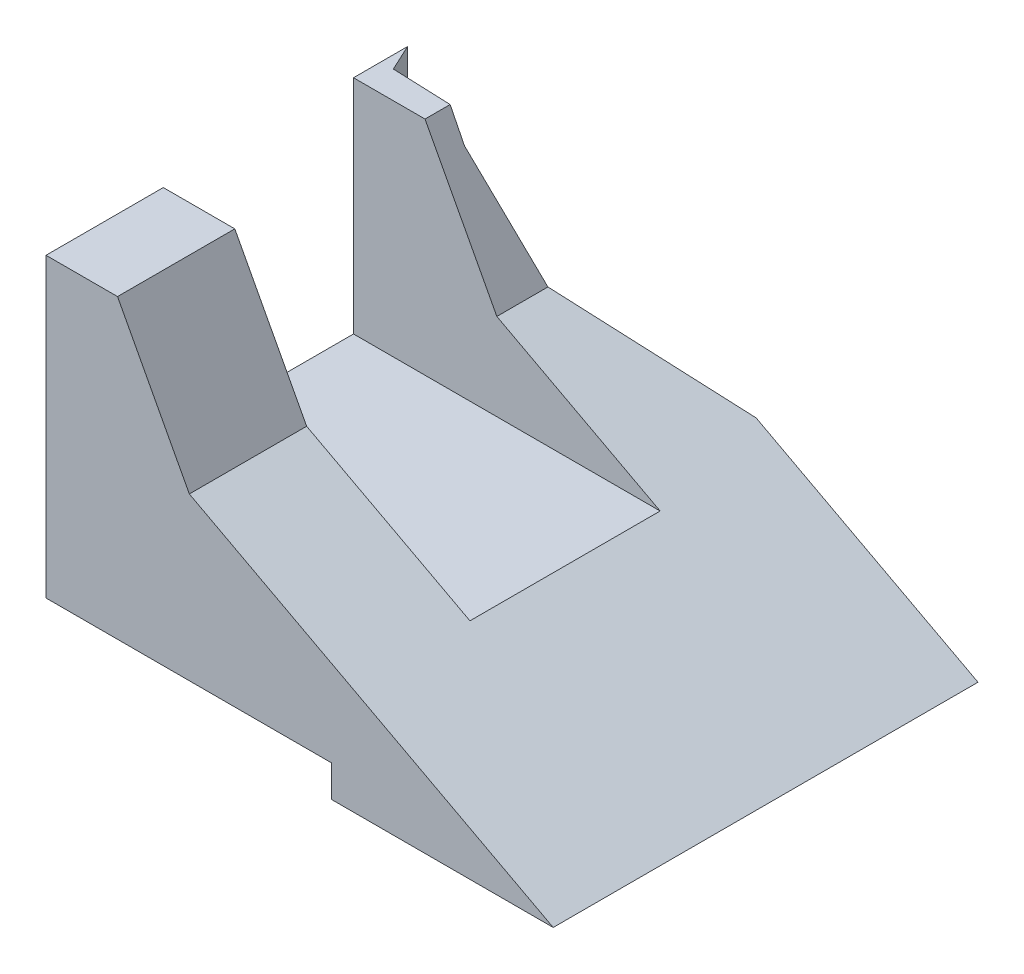
ISO-10303-21;
HEADER;
FILE_DESCRIPTION(('STEP AP214'),'2;1');
FILE_NAME('part.step','',(''),(''),'','','');
FILE_SCHEMA(('AUTOMOTIVE_DESIGN { 1 0 10303 214 1 1 1 1 }'));
ENDSEC;
DATA;
#1=APPLICATION_CONTEXT('core data for automotive mechanical design processes');
#2=APPLICATION_PROTOCOL_DEFINITION('international standard','automotive_design',2000,#1);
#3=PRODUCT_CONTEXT('',#1,'mechanical');
#4=PRODUCT('Part','Part','',(#3));
#5=PRODUCT_RELATED_PRODUCT_CATEGORY('part','',(#4));
#6=PRODUCT_DEFINITION_FORMATION('','',#4);
#7=PRODUCT_DEFINITION_CONTEXT('part definition',#1,'design');
#8=PRODUCT_DEFINITION('design','',#6,#7);
#9=PRODUCT_DEFINITION_SHAPE('','',#8);
#10=(LENGTH_UNIT() NAMED_UNIT(*) SI_UNIT(.MILLI.,.METRE.));
#11=(NAMED_UNIT(*) PLANE_ANGLE_UNIT() SI_UNIT($,.RADIAN.));
#12=(NAMED_UNIT(*) SI_UNIT($,.STERADIAN.) SOLID_ANGLE_UNIT());
#13=UNCERTAINTY_MEASURE_WITH_UNIT(LENGTH_MEASURE(1.E-05),#10,'distance_accuracy_value','');
#14=(GEOMETRIC_REPRESENTATION_CONTEXT(3) GLOBAL_UNCERTAINTY_ASSIGNED_CONTEXT((#13)) GLOBAL_UNIT_ASSIGNED_CONTEXT((#10,
#11,#12)) REPRESENTATION_CONTEXT('',''));
#15=CARTESIAN_POINT('',(0.,0.,0.));
#16=DIRECTION('',(0.,0.,1.));
#17=DIRECTION('',(1.,0.,0.));
#18=AXIS2_PLACEMENT_3D('',#15,#16,#17);
#19=CARTESIAN_POINT('',(80.,51.82,0.));
#20=DIRECTION('',(0.,-1.,0.));
#21=DIRECTION('',(0.,0.,-1.));
#22=AXIS2_PLACEMENT_3D('',#19,#20,#21);
#23=PLANE('',#22);
#24=DIRECTION('',(0.,0.,1.));
#25=VECTOR('',#24,1.);
#26=CARTESIAN_POINT('',(11.2806834744293,51.82,-67.001));
#27=LINE('',#26,#25);
#28=CARTESIAN_POINT('',(11.2806834744293,51.82,-52.4630565569461));
#29=VERTEX_POINT('',#28);
#30=CARTESIAN_POINT('',(11.2806834744293,51.82,-48.5));
#31=VERTEX_POINT('',#30);
#32=EDGE_CURVE('E222',#29,#31,#27,.T.);
#33=ORIENTED_EDGE('',*,*,#32,.F.);
#34=DIRECTION('',(0.99921657202049,0.,0.0395757779408101));
#35=VECTOR('',#34,1.);
#36=CARTESIAN_POINT('',(13.6262026525727,51.82,-52.3701580314919));
#37=LINE('',#36,#35);
#38=CARTESIAN_POINT('',(1.95443562586019,51.82,-52.8324394557201));
#39=VERTEX_POINT('',#38);
#40=EDGE_CURVE('E273',#39,#29,#37,.T.);
#41=ORIENTED_EDGE('',*,*,#40,.F.);
#42=DIRECTION('',(0.422618261740693,0.,0.906307787036653));
#43=VECTOR('',#42,1.);
#44=CARTESIAN_POINT('',(1.95443562586019,51.82,-52.8324394557201));
#45=LINE('',#44,#43);
#46=CARTESIAN_POINT('',(0.,51.82,-57.0237401810678));
#47=VERTEX_POINT('',#46);
#48=EDGE_CURVE('E161',#47,#39,#45,.T.);
#49=ORIENTED_EDGE('',*,*,#48,.F.);
#50=DIRECTION('',(0.,0.,1.));
#51=VECTOR('',#50,1.);
#52=CARTESIAN_POINT('',(0.,51.82,0.));
#53=LINE('',#52,#51);
#54=CARTESIAN_POINT('',(0.,51.82,-48.5));
#55=VERTEX_POINT('',#54);
#56=EDGE_CURVE('E227',#47,#55,#53,.T.);
#57=ORIENTED_EDGE('',*,*,#56,.T.);
#58=DIRECTION('',(-1.,0.,0.));
#59=VECTOR('',#58,1.);
#60=CARTESIAN_POINT('',(0.,51.82,-48.5));
#61=LINE('',#60,#59);
#62=EDGE_CURVE('E191',#31,#55,#61,.T.);
#63=ORIENTED_EDGE('',*,*,#62,.F.);
#64=EDGE_LOOP('',(#33,#41,#49,#57,#63));
#65=FACE_BOUND('',#64,.T.);
#66=ADVANCED_FACE('F33',(#65),#23,.F.);
#67=CARTESIAN_POINT('',(22.6084064641698,30.515651581083,-67.001));
#68=DIRECTION('',(-0.882947592858928,-0.469471562785888,0.));
#69=DIRECTION('',(0.469471562785889,-0.882947592858928,0.));
#70=AXIS2_PLACEMENT_3D('',#67,#68,#69);
#71=PLANE('',#70);
#72=DIRECTION('',(0.,0.,1.));
#73=VECTOR('',#72,1.);
#74=CARTESIAN_POINT('',(22.6084064641698,30.515651581083,-67.001));
#75=LINE('',#74,#73);
#76=CARTESIAN_POINT('',(22.6084064641698,30.515651581083,-56.5586284559486));
#77=VERTEX_POINT('',#76);
#78=CARTESIAN_POINT('',(22.6084064641698,30.515651581083,-48.5));
#79=VERTEX_POINT('',#78);
#80=EDGE_CURVE('E218',#77,#79,#75,.T.);
#81=ORIENTED_EDGE('',*,*,#80,.F.);
#82=DIRECTION('',(0.45861066994838,-0.862521224262136,-0.21385366750852));
#83=VECTOR('',#82,1.);
#84=CARTESIAN_POINT('',(40.4131443501285,-2.97019016959439,-64.8611140836134));
#85=LINE('',#84,#83);
#86=CARTESIAN_POINT('',(13.6262026525727,47.4087200066885,-52.3701580314919));
#87=VERTEX_POINT('',#86);
#88=EDGE_CURVE('E278',#87,#77,#85,.T.);
#89=ORIENTED_EDGE('',*,*,#88,.F.);
#90=DIRECTION('',(0.469390424665507,-0.882794994248578,0.0185910559675182));
#91=VECTOR('',#90,1.);
#92=CARTESIAN_POINT('',(33.2716299026864,10.4610450543633,-51.5920653855396));
#93=LINE('',#92,#91);
#94=EDGE_CURVE('E150',#29,#87,#93,.T.);
#95=ORIENTED_EDGE('',*,*,#94,.F.);
#96=ORIENTED_EDGE('',*,*,#32,.T.);
#97=DIRECTION('',(0.469471562785889,-0.882947592858928,0.));
#98=VECTOR('',#97,1.);
#99=CARTESIAN_POINT('',(22.6084064641698,30.515651581083,-48.5));
#100=LINE('',#99,#98);
#101=EDGE_CURVE('E41',#31,#79,#100,.T.);
#102=ORIENTED_EDGE('',*,*,#101,.T.);
#103=EDGE_LOOP('',(#81,#89,#95,#96,#102));
#104=FACE_BOUND('',#103,.T.);
#105=ADVANCED_FACE('F244',(#104),#71,.F.);
#106=CARTESIAN_POINT('',(80.,0.,0.));
#107=DIRECTION('',(0.,0.,-1.));
#108=DIRECTION('',(-1.,0.,0.));
#109=AXIS2_PLACEMENT_3D('',#106,#107,#108);
#110=PLANE('',#109);
#111=DIRECTION('',(0.,-1.,0.));
#112=VECTOR('',#111,1.);
#113=CARTESIAN_POINT('',(0.,0.,0.));
#114=LINE('',#113,#112);
#115=CARTESIAN_POINT('',(0.,51.82,0.));
#116=VERTEX_POINT('',#115);
#117=CARTESIAN_POINT('',(0.,5.,0.));
#118=VERTEX_POINT('',#117);
#119=EDGE_CURVE('E220',#116,#118,#114,.T.);
#120=ORIENTED_EDGE('',*,*,#119,.T.);
#121=DIRECTION('',(-1.,0.,0.));
#122=VECTOR('',#121,1.);
#123=CARTESIAN_POINT('',(0.,5.,0.));
#124=LINE('',#123,#122);
#125=CARTESIAN_POINT('',(45.,5.,0.));
#126=VERTEX_POINT('',#125);
#127=EDGE_CURVE('E177',#126,#118,#124,.T.);
#128=ORIENTED_EDGE('',*,*,#127,.F.);
#129=DIRECTION('',(0.,1.,0.));
#130=VECTOR('',#129,1.);
#131=CARTESIAN_POINT('',(45.,0.,0.));
#132=LINE('',#131,#130);
#133=CARTESIAN_POINT('',(45.,0.,0.));
#134=VERTEX_POINT('',#133);
#135=EDGE_CURVE('E168',#134,#126,#132,.T.);
#136=ORIENTED_EDGE('',*,*,#135,.F.);
#137=DIRECTION('',(-1.,0.,0.));
#138=VECTOR('',#137,1.);
#139=CARTESIAN_POINT('',(80.,0.,0.));
#140=LINE('',#139,#138);
#141=CARTESIAN_POINT('',(80.,0.,0.));
#142=VERTEX_POINT('',#141);
#143=EDGE_CURVE('E235',#142,#134,#140,.T.);
#144=ORIENTED_EDGE('',*,*,#143,.F.);
#145=DIRECTION('',(0.882947592858926,-0.469471562785892,0.));
#146=VECTOR('',#145,1.);
#147=CARTESIAN_POINT('',(80.,0.,0.));
#148=LINE('',#147,#146);
#149=CARTESIAN_POINT('',(22.6084064641698,30.515651581083,0.));
#150=VERTEX_POINT('',#149);
#151=EDGE_CURVE('E215',#150,#142,#148,.T.);
#152=ORIENTED_EDGE('',*,*,#151,.F.);
#153=DIRECTION('',(0.469471562785889,-0.882947592858928,0.));
#154=VECTOR('',#153,1.);
#155=CARTESIAN_POINT('',(22.6084064641698,30.515651581083,0.));
#156=LINE('',#155,#154);
#157=CARTESIAN_POINT('',(11.2806834744293,51.82,0.));
#158=VERTEX_POINT('',#157);
#159=EDGE_CURVE('E212',#158,#150,#156,.T.);
#160=ORIENTED_EDGE('',*,*,#159,.F.);
#161=DIRECTION('',(-1.,0.,0.));
#162=VECTOR('',#161,1.);
#163=CARTESIAN_POINT('',(80.,51.82,0.));
#164=LINE('',#163,#162);
#165=EDGE_CURVE('E226',#158,#116,#164,.T.);
#166=ORIENTED_EDGE('',*,*,#165,.T.);
#167=EDGE_LOOP('',(#120,#128,#136,#144,#152,#160,#166));
#168=FACE_BOUND('',#167,.T.);
#169=ADVANCED_FACE('F35',(#168),#110,.F.);
#170=CARTESIAN_POINT('',(80.,0.,0.));
#171=DIRECTION('',(0.,1.,0.));
#172=DIRECTION('',(0.,0.,1.));
#173=AXIS2_PLACEMENT_3D('',#170,#171,#172);
#174=PLANE('',#173);
#175=ORIENTED_EDGE('',*,*,#143,.T.);
#176=DIRECTION('',(0.,0.,1.));
#177=VECTOR('',#176,1.);
#178=CARTESIAN_POINT('',(45.,0.,-67.001));
#179=LINE('',#178,#177);
#180=CARTESIAN_POINT('',(45.,0.,-67.));
#181=VERTEX_POINT('',#180);
#182=EDGE_CURVE('E170',#181,#134,#179,.T.);
#183=ORIENTED_EDGE('',*,*,#182,.F.);
#184=DIRECTION('',(-1.,0.,0.));
#185=VECTOR('',#184,1.);
#186=CARTESIAN_POINT('',(80.,0.,-67.));
#187=LINE('',#186,#185);
#188=CARTESIAN_POINT('',(80.,0.,-67.));
#189=VERTEX_POINT('',#188);
#190=EDGE_CURVE('E175',#189,#181,#187,.T.);
#191=ORIENTED_EDGE('',*,*,#190,.F.);
#192=DIRECTION('',(0.,0.,-1.));
#193=VECTOR('',#192,1.);
#194=CARTESIAN_POINT('',(80.,0.,0.));
#195=LINE('',#194,#193);
#196=EDGE_CURVE('E224',#142,#189,#195,.T.);
#197=ORIENTED_EDGE('',*,*,#196,.F.);
#198=EDGE_LOOP('',(#175,#183,#191,#197));
#199=FACE_BOUND('',#198,.T.);
#200=ADVANCED_FACE('F266',(#199),#174,.F.);
#201=CARTESIAN_POINT('',(80.,0.,-67.));
#202=DIRECTION('',(0.,0.,1.));
#203=DIRECTION('',(1.,0.,0.));
#204=AXIS2_PLACEMENT_3D('',#201,#202,#203);
#205=PLANE('',#204);
#206=DIRECTION('',(0.,-1.,0.));
#207=VECTOR('',#206,1.);
#208=CARTESIAN_POINT('',(45.,0.,-67.));
#209=LINE('',#208,#207);
#210=CARTESIAN_POINT('',(45.,5.,-67.));
#211=VERTEX_POINT('',#210);
#212=EDGE_CURVE('E165',#211,#181,#209,.T.);
#213=ORIENTED_EDGE('',*,*,#212,.F.);
#214=DIRECTION('',(0.,-1.,0.));
#215=VECTOR('',#214,1.);
#216=CARTESIAN_POINT('',(45.,-0.001000000000001,-67.));
#217=LINE('',#216,#215);
#218=CARTESIAN_POINT('',(44.9999999999999,18.6098301081518,-67.));
#219=VERTEX_POINT('',#218);
#220=EDGE_CURVE('E138',#219,#211,#217,.T.);
#221=ORIENTED_EDGE('',*,*,#220,.F.);
#222=DIRECTION('',(-0.882947592858926,0.469471562785892,0.));
#223=VECTOR('',#222,1.);
#224=CARTESIAN_POINT('',(80.,0.,-67.));
#225=LINE('',#224,#223);
#226=EDGE_CURVE('E210',#189,#219,#225,.T.);
#227=ORIENTED_EDGE('',*,*,#226,.F.);
#228=ORIENTED_EDGE('',*,*,#190,.T.);
#229=EDGE_LOOP('',(#213,#221,#227,#228));
#230=FACE_BOUND('',#229,.T.);
#231=ADVANCED_FACE('F173',(#230),#205,.F.);
#232=CARTESIAN_POINT('',(11.2806834744293,51.82,-18.5));
#233=VERTEX_POINT('',#232);
#234=EDGE_CURVE('E217',#233,#158,#27,.T.);
#235=ORIENTED_EDGE('',*,*,#234,.F.);
#236=DIRECTION('',(1.,0.,0.));
#237=VECTOR('',#236,1.);
#238=CARTESIAN_POINT('',(0.,51.82,-18.5));
#239=LINE('',#238,#237);
#240=CARTESIAN_POINT('',(0.,51.82,-18.5));
#241=VERTEX_POINT('',#240);
#242=EDGE_CURVE('E184',#241,#233,#239,.T.);
#243=ORIENTED_EDGE('',*,*,#242,.F.);
#244=EDGE_CURVE('E230',#241,#116,#53,.T.);
#245=ORIENTED_EDGE('',*,*,#244,.T.);
#246=ORIENTED_EDGE('',*,*,#165,.F.);
#247=EDGE_LOOP('',(#235,#243,#245,#246));
#248=FACE_BOUND('',#247,.T.);
#249=ADVANCED_FACE('F293',(#248),#23,.F.);
#250=CARTESIAN_POINT('',(0.,0.,0.));
#251=DIRECTION('',(-1.,0.,0.));
#252=DIRECTION('',(0.,0.,1.));
#253=AXIS2_PLACEMENT_3D('',#250,#251,#252);
#254=PLANE('',#253);
#255=DIRECTION('',(0.,-1.,0.));
#256=VECTOR('',#255,1.);
#257=CARTESIAN_POINT('',(0.,-0.001000000000001,-57.0237401810678));
#258=LINE('',#257,#256);
#259=CARTESIAN_POINT('',(0.,5.,-57.0237401810678));
#260=VERTEX_POINT('',#259);
#261=EDGE_CURVE('E151',#47,#260,#258,.T.);
#262=ORIENTED_EDGE('',*,*,#261,.T.);
#263=DIRECTION('',(0.,0.,1.));
#264=VECTOR('',#263,1.);
#265=CARTESIAN_POINT('',(0.,5.,-67.001));
#266=LINE('',#265,#264);
#267=EDGE_CURVE('E56',#260,#118,#266,.T.);
#268=ORIENTED_EDGE('',*,*,#267,.T.);
#269=ORIENTED_EDGE('',*,*,#119,.F.);
#270=ORIENTED_EDGE('',*,*,#244,.F.);
#271=DIRECTION('',(0.,1.,0.));
#272=VECTOR('',#271,1.);
#273=CARTESIAN_POINT('',(0.,16.82,-18.5));
#274=LINE('',#273,#272);
#275=CARTESIAN_POINT('',(0.,16.82,-18.5));
#276=VERTEX_POINT('',#275);
#277=EDGE_CURVE('E196',#276,#241,#274,.T.);
#278=ORIENTED_EDGE('',*,*,#277,.F.);
#279=DIRECTION('',(0.,0.,1.));
#280=VECTOR('',#279,1.);
#281=CARTESIAN_POINT('',(0.,16.82,-18.5));
#282=LINE('',#281,#280);
#283=CARTESIAN_POINT('',(0.,16.82,-48.5));
#284=VERTEX_POINT('',#283);
#285=EDGE_CURVE('E187',#284,#276,#282,.T.);
#286=ORIENTED_EDGE('',*,*,#285,.F.);
#287=DIRECTION('',(0.,1.,0.));
#288=VECTOR('',#287,1.);
#289=CARTESIAN_POINT('',(0.,16.82,-48.5));
#290=LINE('',#289,#288);
#291=EDGE_CURVE('E200',#284,#55,#290,.T.);
#292=ORIENTED_EDGE('',*,*,#291,.T.);
#293=ORIENTED_EDGE('',*,*,#56,.F.);
#294=EDGE_LOOP('',(#262,#268,#269,#270,#278,#286,#292,#293));
#295=FACE_BOUND('',#294,.T.);
#296=ADVANCED_FACE('F258',(#295),#254,.T.);
#297=CARTESIAN_POINT('',(80.,0.,-67.001));
#298=DIRECTION('',(-0.469471562785892,-0.882947592858927,0.));
#299=DIRECTION('',(0.882947592858926,-0.469471562785892,0.));
#300=AXIS2_PLACEMENT_3D('',#297,#298,#299);
#301=PLANE('',#300);
#302=ORIENTED_EDGE('',*,*,#226,.T.);
#303=DIRECTION('',(0.816453649719839,-0.434116106070477,-0.380718589392953));
#304=VECTOR('',#303,1.);
#305=CARTESIAN_POINT('',(51.596342209922,15.1024927406696,-70.0759248882976));
#306=LINE('',#305,#304);
#307=EDGE_CURVE('E145',#77,#219,#306,.T.);
#308=ORIENTED_EDGE('',*,*,#307,.F.);
#309=ORIENTED_EDGE('',*,*,#80,.T.);
#310=DIRECTION('',(0.882947592858926,-0.469471562785892,0.));
#311=VECTOR('',#310,1.);
#312=CARTESIAN_POINT('',(80.,0.,-48.5));
#313=LINE('',#312,#311);
#314=CARTESIAN_POINT('',(48.3661808528748,16.82,-48.5));
#315=VERTEX_POINT('',#314);
#316=EDGE_CURVE('E207',#79,#315,#313,.T.);
#317=ORIENTED_EDGE('',*,*,#316,.T.);
#318=DIRECTION('',(0.,0.,1.));
#319=VECTOR('',#318,1.);
#320=CARTESIAN_POINT('',(48.3661808528748,16.82,-67.001));
#321=LINE('',#320,#319);
#322=CARTESIAN_POINT('',(48.3661808528748,16.82,-18.5));
#323=VERTEX_POINT('',#322);
#324=EDGE_CURVE('E11',#315,#323,#321,.T.);
#325=ORIENTED_EDGE('',*,*,#324,.T.);
#326=DIRECTION('',(-0.882947592858926,0.469471562785892,0.));
#327=VECTOR('',#326,1.);
#328=CARTESIAN_POINT('',(80.,0.,-18.5));
#329=LINE('',#328,#327);
#330=CARTESIAN_POINT('',(22.6084064641698,30.515651581083,-18.5));
#331=VERTEX_POINT('',#330);
#332=EDGE_CURVE('E203',#323,#331,#329,.T.);
#333=ORIENTED_EDGE('',*,*,#332,.T.);
#334=EDGE_CURVE('E221',#331,#150,#75,.T.);
#335=ORIENTED_EDGE('',*,*,#334,.T.);
#336=ORIENTED_EDGE('',*,*,#151,.T.);
#337=ORIENTED_EDGE('',*,*,#196,.T.);
#338=EDGE_LOOP('',(#302,#308,#309,#317,#325,#333,#335,#336,#337));
#339=FACE_BOUND('',#338,.T.);
#340=ADVANCED_FACE('F263',(#339),#301,.F.);
#341=ORIENTED_EDGE('',*,*,#334,.F.);
#342=DIRECTION('',(-0.469471562785889,0.882947592858928,0.));
#343=VECTOR('',#342,1.);
#344=CARTESIAN_POINT('',(22.6084064641698,30.515651581083,-18.5));
#345=LINE('',#344,#343);
#346=EDGE_CURVE('E238',#331,#233,#345,.T.);
#347=ORIENTED_EDGE('',*,*,#346,.T.);
#348=ORIENTED_EDGE('',*,*,#234,.T.);
#349=ORIENTED_EDGE('',*,*,#159,.T.);
#350=EDGE_LOOP('',(#341,#347,#348,#349));
#351=FACE_BOUND('',#350,.T.);
#352=ADVANCED_FACE('F299',(#351),#71,.F.);
#353=CARTESIAN_POINT('',(0.,16.82,0.));
#354=DIRECTION('',(0.,-1.,0.));
#355=DIRECTION('',(0.,0.,-1.));
#356=AXIS2_PLACEMENT_3D('',#353,#354,#355);
#357=PLANE('',#356);
#358=DIRECTION('',(-1.,0.,0.));
#359=VECTOR('',#358,1.);
#360=CARTESIAN_POINT('',(0.,16.82,-48.5));
#361=LINE('',#360,#359);
#362=EDGE_CURVE('E194',#315,#284,#361,.T.);
#363=ORIENTED_EDGE('',*,*,#362,.T.);
#364=ORIENTED_EDGE('',*,*,#285,.T.);
#365=DIRECTION('',(1.,0.,0.));
#366=VECTOR('',#365,1.);
#367=CARTESIAN_POINT('',(0.,16.82,-18.5));
#368=LINE('',#367,#366);
#369=EDGE_CURVE('E190',#276,#323,#368,.T.);
#370=ORIENTED_EDGE('',*,*,#369,.T.);
#371=ORIENTED_EDGE('',*,*,#324,.F.);
#372=EDGE_LOOP('',(#363,#364,#370,#371));
#373=FACE_BOUND('',#372,.T.);
#374=ADVANCED_FACE('F319',(#373),#357,.F.);
#375=CARTESIAN_POINT('',(0.,16.82,-48.5));
#376=DIRECTION('',(0.,0.,-1.));
#377=DIRECTION('',(-1.,0.,0.));
#378=AXIS2_PLACEMENT_3D('',#375,#376,#377);
#379=PLANE('',#378);
#380=ORIENTED_EDGE('',*,*,#101,.F.);
#381=ORIENTED_EDGE('',*,*,#62,.T.);
#382=ORIENTED_EDGE('',*,*,#291,.F.);
#383=ORIENTED_EDGE('',*,*,#362,.F.);
#384=ORIENTED_EDGE('',*,*,#316,.F.);
#385=EDGE_LOOP('',(#380,#381,#382,#383,#384));
#386=FACE_BOUND('',#385,.T.);
#387=ADVANCED_FACE('F251',(#386),#379,.F.);
#388=CARTESIAN_POINT('',(0.,16.82,-18.5));
#389=DIRECTION('',(0.,0.,1.));
#390=DIRECTION('',(1.,0.,0.));
#391=AXIS2_PLACEMENT_3D('',#388,#389,#390);
#392=PLANE('',#391);
#393=ORIENTED_EDGE('',*,*,#369,.F.);
#394=ORIENTED_EDGE('',*,*,#277,.T.);
#395=ORIENTED_EDGE('',*,*,#242,.T.);
#396=ORIENTED_EDGE('',*,*,#346,.F.);
#397=ORIENTED_EDGE('',*,*,#332,.F.);
#398=EDGE_LOOP('',(#393,#394,#395,#396,#397));
#399=FACE_BOUND('',#398,.T.);
#400=ADVANCED_FACE('F318',(#399),#392,.F.);
#401=CARTESIAN_POINT('',(0.,5.,-67.001));
#402=DIRECTION('',(0.,1.,0.));
#403=DIRECTION('',(0.,0.,1.));
#404=AXIS2_PLACEMENT_3D('',#401,#402,#403);
#405=PLANE('',#404);
#406=DIRECTION('',(-0.99921657202049,0.,-0.0395757779408101));
#407=VECTOR('',#406,1.);
#408=CARTESIAN_POINT('',(13.6262026525727,5.,-52.3701580314919));
#409=LINE('',#408,#407);
#410=CARTESIAN_POINT('',(13.6262026525727,5.,-52.3701580314919));
#411=VERTEX_POINT('',#410);
#412=CARTESIAN_POINT('',(1.95443562586019,5.,-52.8324394557201));
#413=VERTEX_POINT('',#412);
#414=EDGE_CURVE('E160',#411,#413,#409,.T.);
#415=ORIENTED_EDGE('',*,*,#414,.F.);
#416=DIRECTION('',(-0.906307787036653,0.,0.422618261740694));
#417=VECTOR('',#416,1.);
#418=CARTESIAN_POINT('',(45.,5.,-67.));
#419=LINE('',#418,#417);
#420=EDGE_CURVE('E142',#211,#411,#419,.T.);
#421=ORIENTED_EDGE('',*,*,#420,.F.);
#422=DIRECTION('',(0.,0.,1.));
#423=VECTOR('',#422,1.);
#424=CARTESIAN_POINT('',(45.,5.,-67.001));
#425=LINE('',#424,#423);
#426=EDGE_CURVE('E157',#211,#126,#425,.T.);
#427=ORIENTED_EDGE('',*,*,#426,.T.);
#428=ORIENTED_EDGE('',*,*,#127,.T.);
#429=ORIENTED_EDGE('',*,*,#267,.F.);
#430=DIRECTION('',(-0.422618261740693,0.,-0.906307787036653));
#431=VECTOR('',#430,1.);
#432=CARTESIAN_POINT('',(1.95443562586019,5.,-52.8324394557201));
#433=LINE('',#432,#431);
#434=EDGE_CURVE('E179',#413,#260,#433,.T.);
#435=ORIENTED_EDGE('',*,*,#434,.F.);
#436=EDGE_LOOP('',(#415,#421,#427,#428,#429,#435));
#437=FACE_BOUND('',#436,.T.);
#438=ADVANCED_FACE('F156',(#437),#405,.F.);
#439=CARTESIAN_POINT('',(45.,0.,-67.001));
#440=DIRECTION('',(1.,0.,0.));
#441=DIRECTION('',(0.,0.,-1.));
#442=AXIS2_PLACEMENT_3D('',#439,#440,#441);
#443=PLANE('',#442);
#444=ORIENTED_EDGE('',*,*,#212,.T.);
#445=ORIENTED_EDGE('',*,*,#182,.T.);
#446=ORIENTED_EDGE('',*,*,#135,.T.);
#447=ORIENTED_EDGE('',*,*,#426,.F.);
#448=EDGE_LOOP('',(#444,#445,#446,#447));
#449=FACE_BOUND('',#448,.T.);
#450=ADVANCED_FACE('F164',(#449),#443,.F.);
#451=CARTESIAN_POINT('',(45.,-0.001000000000001,-67.));
#452=DIRECTION('',(0.422618261740694,0.,0.906307787036653));
#453=DIRECTION('',(0.906307787036653,0.,-0.422618261740694));
#454=AXIS2_PLACEMENT_3D('',#451,#452,#453);
#455=PLANE('',#454);
#456=ORIENTED_EDGE('',*,*,#88,.T.);
#457=ORIENTED_EDGE('',*,*,#307,.T.);
#458=ORIENTED_EDGE('',*,*,#220,.T.);
#459=ORIENTED_EDGE('',*,*,#420,.T.);
#460=DIRECTION('',(0.,1.,0.));
#461=VECTOR('',#460,1.);
#462=CARTESIAN_POINT('',(13.6262026525727,-0.001000000000001,-52.3701580314919));
#463=LINE('',#462,#461);
#464=EDGE_CURVE('E270',#411,#87,#463,.T.);
#465=ORIENTED_EDGE('',*,*,#464,.T.);
#466=EDGE_LOOP('',(#456,#457,#458,#459,#465));
#467=FACE_BOUND('',#466,.T.);
#468=ADVANCED_FACE('F140',(#467),#455,.F.);
#469=CARTESIAN_POINT('',(13.6262026525727,-0.001000000000001,-52.3701580314919));
#470=DIRECTION('',(-0.0395757779408101,0.,0.99921657202049));
#471=DIRECTION('',(0.99921657202049,0.,0.0395757779408101));
#472=AXIS2_PLACEMENT_3D('',#469,#470,#471);
#473=PLANE('',#472);
#474=ORIENTED_EDGE('',*,*,#94,.T.);
#475=ORIENTED_EDGE('',*,*,#464,.F.);
#476=ORIENTED_EDGE('',*,*,#414,.T.);
#477=DIRECTION('',(0.,1.,0.));
#478=VECTOR('',#477,1.);
#479=CARTESIAN_POINT('',(1.95443562586019,-0.001000000000001,-52.8324394557201));
#480=LINE('',#479,#478);
#481=EDGE_CURVE('E48',#413,#39,#480,.T.);
#482=ORIENTED_EDGE('',*,*,#481,.T.);
#483=ORIENTED_EDGE('',*,*,#40,.T.);
#484=EDGE_LOOP('',(#474,#475,#476,#482,#483));
#485=FACE_BOUND('',#484,.T.);
#486=ADVANCED_FACE('F282',(#485),#473,.F.);
#487=CARTESIAN_POINT('',(1.95443562586019,-0.001000000000001,-52.8324394557201));
#488=DIRECTION('',(-0.906307787036653,0.,0.422618261740693));
#489=DIRECTION('',(0.422618261740693,0.,0.906307787036653));
#490=AXIS2_PLACEMENT_3D('',#487,#488,#489);
#491=PLANE('',#490);
#492=ORIENTED_EDGE('',*,*,#48,.T.);
#493=ORIENTED_EDGE('',*,*,#481,.F.);
#494=ORIENTED_EDGE('',*,*,#434,.T.);
#495=ORIENTED_EDGE('',*,*,#261,.F.);
#496=EDGE_LOOP('',(#492,#493,#494,#495));
#497=FACE_BOUND('',#496,.T.);
#498=ADVANCED_FACE('F283',(#497),#491,.F.);
#499=CLOSED_SHELL('',(#66,#105,#169,#200,#231,#249,#296,#340,#352,#374,#387,#400,#438,#450,#468,
#486,#498));
#500=MANIFOLD_SOLID_BREP('B2',#499);
#501=ADVANCED_BREP_SHAPE_REPRESENTATION('',(#18,#500),#14);
#502=SHAPE_DEFINITION_REPRESENTATION(#9,#501);
ENDSEC;
END-ISO-10303-21;
